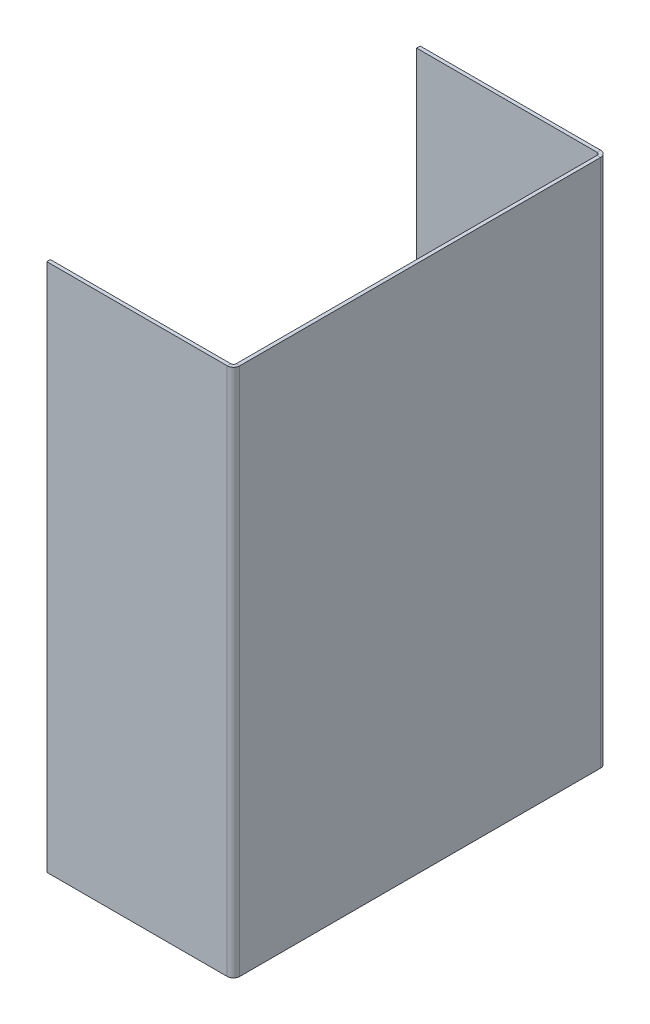
ISO-10303-21;
HEADER;
FILE_DESCRIPTION(('STEP AP214'),'2;1');
FILE_NAME('part.step','',(''),(''),'','','');
FILE_SCHEMA(('AUTOMOTIVE_DESIGN { 1 0 10303 214 1 1 1 1 }'));
ENDSEC;
DATA;
#1=APPLICATION_CONTEXT('core data for automotive mechanical design processes');
#2=APPLICATION_PROTOCOL_DEFINITION('international standard','automotive_design',2000,#1);
#3=PRODUCT_CONTEXT('',#1,'mechanical');
#4=PRODUCT('Part','Part','',(#3));
#5=PRODUCT_RELATED_PRODUCT_CATEGORY('part','',(#4));
#6=PRODUCT_DEFINITION_FORMATION('','',#4);
#7=PRODUCT_DEFINITION_CONTEXT('part definition',#1,'design');
#8=PRODUCT_DEFINITION('design','',#6,#7);
#9=PRODUCT_DEFINITION_SHAPE('','',#8);
#10=(LENGTH_UNIT() NAMED_UNIT(*) SI_UNIT(.MILLI.,.METRE.));
#11=(NAMED_UNIT(*) PLANE_ANGLE_UNIT() SI_UNIT($,.RADIAN.));
#12=(NAMED_UNIT(*) SI_UNIT($,.STERADIAN.) SOLID_ANGLE_UNIT());
#13=UNCERTAINTY_MEASURE_WITH_UNIT(LENGTH_MEASURE(1.E-05),#10,'distance_accuracy_value','');
#14=(GEOMETRIC_REPRESENTATION_CONTEXT(3) GLOBAL_UNCERTAINTY_ASSIGNED_CONTEXT((#13)) GLOBAL_UNIT_ASSIGNED_CONTEXT((#10,
#11,#12)) REPRESENTATION_CONTEXT('',''));
#15=CARTESIAN_POINT('',(0.,0.,0.));
#16=DIRECTION('',(0.,0.,1.));
#17=DIRECTION('',(1.,0.,0.));
#18=AXIS2_PLACEMENT_3D('',#15,#16,#17);
#19=CARTESIAN_POINT('',(51.5596680025109,146.05,-51.0309319974893));
#20=DIRECTION('',(0.,1.,0.));
#21=DIRECTION('',(-1.,0.,0.));
#22=AXIS2_PLACEMENT_3D('',#19,#20,#21);
#23=PLANE('',#22);
#24=DIRECTION('',(0.,0.,-1.));
#25=VECTOR('',#24,1.);
#26=CARTESIAN_POINT('',(50.5690680025109,146.05,-51.0309319974893));
#27=LINE('',#26,#25);
#28=CARTESIAN_POINT('',(50.5690680025103,146.05,100.401536005021));
#29=VERTEX_POINT('',#28);
#30=CARTESIAN_POINT('',(50.5690680025107,146.05,0.736600000000011));
#31=VERTEX_POINT('',#30);
#32=EDGE_CURVE('E74',#29,#31,#27,.T.);
#33=ORIENTED_EDGE('',*,*,#32,.F.);
#34=DIRECTION('',(1.,0.,0.));
#35=VECTOR('',#34,1.);
#36=CARTESIAN_POINT('',(51.5596680025104,146.05,100.401536005021));
#37=LINE('',#36,#35);
#38=CARTESIAN_POINT('',(51.5596680025103,146.05,100.401536005021));
#39=VERTEX_POINT('',#38);
#40=EDGE_CURVE('E244',#29,#39,#37,.T.);
#41=ORIENTED_EDGE('',*,*,#40,.T.);
#42=DIRECTION('',(0.,0.,-1.));
#43=VECTOR('',#42,1.);
#44=CARTESIAN_POINT('',(51.5596680025109,146.05,-51.0309319974893));
#45=LINE('',#44,#43);
#46=CARTESIAN_POINT('',(51.5596680025107,146.05,0.736600000000011));
#47=VERTEX_POINT('',#46);
#48=EDGE_CURVE('E53',#39,#47,#45,.T.);
#49=ORIENTED_EDGE('',*,*,#48,.T.);
#50=DIRECTION('',(1.,0.,0.));
#51=VECTOR('',#50,1.);
#52=CARTESIAN_POINT('',(51.5596680025107,146.05,0.736600000000011));
#53=LINE('',#52,#51);
#54=EDGE_CURVE('E238',#31,#47,#53,.T.);
#55=ORIENTED_EDGE('',*,*,#54,.F.);
#56=EDGE_LOOP('',(#33,#41,#49,#55));
#57=FACE_BOUND('',#56,.T.);
#58=ADVANCED_FACE('F49',(#57),#23,.T.);
#59=CARTESIAN_POINT('',(51.5596680025109,0.,-51.0309319974893));
#60=DIRECTION('',(0.,-1.,0.));
#61=DIRECTION('',(1.,0.,0.));
#62=AXIS2_PLACEMENT_3D('',#59,#60,#61);
#63=PLANE('',#62);
#64=DIRECTION('',(0.,0.,1.));
#65=VECTOR('',#64,1.);
#66=CARTESIAN_POINT('',(51.5596680025109,0.,-51.0309319974893));
#67=LINE('',#66,#65);
#68=CARTESIAN_POINT('',(51.5596680025107,0.,0.736600000000003));
#69=VERTEX_POINT('',#68);
#70=CARTESIAN_POINT('',(51.5596680025104,0.,100.401536005021));
#71=VERTEX_POINT('',#70);
#72=EDGE_CURVE('E248',#69,#71,#67,.T.);
#73=ORIENTED_EDGE('',*,*,#72,.T.);
#74=DIRECTION('',(-1.,0.,0.));
#75=VECTOR('',#74,1.);
#76=CARTESIAN_POINT('',(51.5596680025104,0.,100.401536005021));
#77=LINE('',#76,#75);
#78=CARTESIAN_POINT('',(50.5690680025103,0.,100.401536005021));
#79=VERTEX_POINT('',#78);
#80=EDGE_CURVE('E12',#71,#79,#77,.T.);
#81=ORIENTED_EDGE('',*,*,#80,.T.);
#82=DIRECTION('',(0.,0.,1.));
#83=VECTOR('',#82,1.);
#84=CARTESIAN_POINT('',(50.5690680025109,0.,-51.0309319974893));
#85=LINE('',#84,#83);
#86=CARTESIAN_POINT('',(50.5690680025107,0.,0.736600000000004));
#87=VERTEX_POINT('',#86);
#88=EDGE_CURVE('E200',#87,#79,#85,.T.);
#89=ORIENTED_EDGE('',*,*,#88,.F.);
#90=DIRECTION('',(-1.,0.,0.));
#91=VECTOR('',#90,1.);
#92=CARTESIAN_POINT('',(51.5596680025107,0.,0.736600000000011));
#93=LINE('',#92,#91);
#94=EDGE_CURVE('E233',#69,#87,#93,.T.);
#95=ORIENTED_EDGE('',*,*,#94,.F.);
#96=EDGE_LOOP('',(#73,#81,#89,#95));
#97=FACE_BOUND('',#96,.T.);
#98=ADVANCED_FACE('F51',(#97),#63,.T.);
#99=CARTESIAN_POINT('',(51.5596680025109,0.,-51.0309319974893));
#100=DIRECTION('',(1.,0.,0.));
#101=DIRECTION('',(0.,0.,-1.));
#102=AXIS2_PLACEMENT_3D('',#99,#100,#101);
#103=PLANE('',#102);
#104=ORIENTED_EDGE('',*,*,#48,.F.);
#105=DIRECTION('',(0.,-1.,0.));
#106=VECTOR('',#105,1.);
#107=CARTESIAN_POINT('',(51.5596680025103,0.,100.401536005021));
#108=LINE('',#107,#106);
#109=EDGE_CURVE('E241',#39,#71,#108,.T.);
#110=ORIENTED_EDGE('',*,*,#109,.T.);
#111=ORIENTED_EDGE('',*,*,#72,.F.);
#112=DIRECTION('',(0.,-1.,0.));
#113=VECTOR('',#112,1.);
#114=CARTESIAN_POINT('',(51.5596680025107,0.,0.736600000000011));
#115=LINE('',#114,#113);
#116=EDGE_CURVE('E230',#47,#69,#115,.T.);
#117=ORIENTED_EDGE('',*,*,#116,.F.);
#118=EDGE_LOOP('',(#104,#110,#111,#117));
#119=FACE_BOUND('',#118,.T.);
#120=ADVANCED_FACE('F263',(#119),#103,.T.);
#121=CARTESIAN_POINT('',(50.5690680025109,0.,-51.0309319974893));
#122=DIRECTION('',(1.,0.,0.));
#123=DIRECTION('',(0.,0.,-1.));
#124=AXIS2_PLACEMENT_3D('',#121,#122,#123);
#125=PLANE('',#124);
#126=DIRECTION('',(0.,-1.,0.));
#127=VECTOR('',#126,1.);
#128=CARTESIAN_POINT('',(50.5690680025103,0.,100.401536005021));
#129=LINE('',#128,#127);
#130=EDGE_CURVE('E58',#29,#79,#129,.T.);
#131=ORIENTED_EDGE('',*,*,#130,.F.);
#132=ORIENTED_EDGE('',*,*,#32,.T.);
#133=DIRECTION('',(0.,-1.,0.));
#134=VECTOR('',#133,1.);
#135=CARTESIAN_POINT('',(50.5690680025107,0.,0.736600000000011));
#136=LINE('',#135,#134);
#137=EDGE_CURVE('E236',#31,#87,#136,.T.);
#138=ORIENTED_EDGE('',*,*,#137,.T.);
#139=ORIENTED_EDGE('',*,*,#88,.T.);
#140=EDGE_LOOP('',(#131,#132,#138,#139));
#141=FACE_BOUND('',#140,.T.);
#142=ADVANCED_FACE('F252',(#141),#125,.F.);
#143=CARTESIAN_POINT('',(0.,0.,-0.9906));
#144=DIRECTION('',(-1.,0.,0.));
#145=DIRECTION('',(0.,0.,1.));
#146=AXIS2_PLACEMENT_3D('',#143,#144,#145);
#147=PLANE('',#146);
#148=DIRECTION('',(0.,-1.,0.));
#149=VECTOR('',#148,1.);
#150=CARTESIAN_POINT('',(0.,0.,0.));
#151=LINE('',#150,#149);
#152=CARTESIAN_POINT('',(0.,146.05,0.));
#153=VERTEX_POINT('',#152);
#154=CARTESIAN_POINT('',(0.,0.,0.));
#155=VERTEX_POINT('',#154);
#156=EDGE_CURVE('E209',#153,#155,#151,.T.);
#157=ORIENTED_EDGE('',*,*,#156,.F.);
#158=DIRECTION('',(0.,0.,1.));
#159=VECTOR('',#158,1.);
#160=CARTESIAN_POINT('',(0.,146.05,-0.9906));
#161=LINE('',#160,#159);
#162=CARTESIAN_POINT('',(0.,146.05,-0.9906));
#163=VERTEX_POINT('',#162);
#164=EDGE_CURVE('E197',#163,#153,#161,.T.);
#165=ORIENTED_EDGE('',*,*,#164,.F.);
#166=DIRECTION('',(0.,-1.,0.));
#167=VECTOR('',#166,1.);
#168=CARTESIAN_POINT('',(0.,0.,-0.9906));
#169=LINE('',#168,#167);
#170=CARTESIAN_POINT('',(0.,0.,-0.9906));
#171=VERTEX_POINT('',#170);
#172=EDGE_CURVE('E225',#163,#171,#169,.T.);
#173=ORIENTED_EDGE('',*,*,#172,.T.);
#174=DIRECTION('',(0.,0.,1.));
#175=VECTOR('',#174,1.);
#176=CARTESIAN_POINT('',(0.,0.,-0.9906));
#177=LINE('',#176,#175);
#178=EDGE_CURVE('E223',#171,#155,#177,.T.);
#179=ORIENTED_EDGE('',*,*,#178,.T.);
#180=EDGE_LOOP('',(#157,#165,#173,#179));
#181=FACE_BOUND('',#180,.T.);
#182=ADVANCED_FACE('F302',(#181),#147,.T.);
#183=CARTESIAN_POINT('',(0.,0.,-0.9906));
#184=DIRECTION('',(0.,0.,-1.));
#185=DIRECTION('',(-1.,0.,0.));
#186=AXIS2_PLACEMENT_3D('',#183,#184,#185);
#187=PLANE('',#186);
#188=DIRECTION('',(-1.,0.,0.));
#189=VECTOR('',#188,1.);
#190=CARTESIAN_POINT('',(0.,146.05,-0.9906));
#191=LINE('',#190,#189);
#192=CARTESIAN_POINT('',(49.8324680025107,146.05,-0.9906));
#193=VERTEX_POINT('',#192);
#194=EDGE_CURVE('E201',#193,#163,#191,.T.);
#195=ORIENTED_EDGE('',*,*,#194,.F.);
#196=DIRECTION('',(0.,-1.,0.));
#197=VECTOR('',#196,1.);
#198=CARTESIAN_POINT('',(49.8324680025107,0.,-0.9906));
#199=LINE('',#198,#197);
#200=CARTESIAN_POINT('',(49.8324680025107,0.,-0.9906));
#201=VERTEX_POINT('',#200);
#202=EDGE_CURVE('E220',#193,#201,#199,.T.);
#203=ORIENTED_EDGE('',*,*,#202,.T.);
#204=DIRECTION('',(1.,0.,0.));
#205=VECTOR('',#204,1.);
#206=CARTESIAN_POINT('',(0.,0.,-0.9906));
#207=LINE('',#206,#205);
#208=EDGE_CURVE('E217',#171,#201,#207,.T.);
#209=ORIENTED_EDGE('',*,*,#208,.F.);
#210=ORIENTED_EDGE('',*,*,#172,.F.);
#211=EDGE_LOOP('',(#195,#203,#209,#210));
#212=FACE_BOUND('',#211,.T.);
#213=ADVANCED_FACE('F307',(#212),#187,.T.);
#214=CARTESIAN_POINT('',(0.,0.,-0.9906));
#215=DIRECTION('',(0.,-1.,0.));
#216=DIRECTION('',(0.,0.,-1.));
#217=AXIS2_PLACEMENT_3D('',#214,#215,#216);
#218=PLANE('',#217);
#219=ORIENTED_EDGE('',*,*,#208,.T.);
#220=DIRECTION('',(0.,0.,1.));
#221=VECTOR('',#220,1.);
#222=CARTESIAN_POINT('',(49.8324680025107,0.,-0.9906));
#223=LINE('',#222,#221);
#224=CARTESIAN_POINT('',(49.8324680025107,0.,0.));
#225=VERTEX_POINT('',#224);
#226=EDGE_CURVE('E214',#201,#225,#223,.T.);
#227=ORIENTED_EDGE('',*,*,#226,.T.);
#228=DIRECTION('',(1.,0.,0.));
#229=VECTOR('',#228,1.);
#230=CARTESIAN_POINT('',(0.,0.,0.));
#231=LINE('',#230,#229);
#232=EDGE_CURVE('E206',#155,#225,#231,.T.);
#233=ORIENTED_EDGE('',*,*,#232,.F.);
#234=ORIENTED_EDGE('',*,*,#178,.F.);
#235=EDGE_LOOP('',(#219,#227,#233,#234));
#236=FACE_BOUND('',#235,.T.);
#237=ADVANCED_FACE('F483',(#236),#218,.T.);
#238=CARTESIAN_POINT('',(0.,0.,0.));
#239=DIRECTION('',(0.,0.,-1.));
#240=DIRECTION('',(-1.,0.,0.));
#241=AXIS2_PLACEMENT_3D('',#238,#239,#240);
#242=PLANE('',#241);
#243=DIRECTION('',(0.,-1.,0.));
#244=VECTOR('',#243,1.);
#245=CARTESIAN_POINT('',(49.8324680025107,0.,0.));
#246=LINE('',#245,#244);
#247=CARTESIAN_POINT('',(49.8324680025107,146.05,0.));
#248=VERTEX_POINT('',#247);
#249=EDGE_CURVE('E193',#248,#225,#246,.T.);
#250=ORIENTED_EDGE('',*,*,#249,.F.);
#251=DIRECTION('',(-1.,0.,0.));
#252=VECTOR('',#251,1.);
#253=CARTESIAN_POINT('',(0.,146.05,0.));
#254=LINE('',#253,#252);
#255=EDGE_CURVE('E212',#248,#153,#254,.T.);
#256=ORIENTED_EDGE('',*,*,#255,.T.);
#257=ORIENTED_EDGE('',*,*,#156,.T.);
#258=ORIENTED_EDGE('',*,*,#232,.T.);
#259=EDGE_LOOP('',(#250,#256,#257,#258));
#260=FACE_BOUND('',#259,.T.);
#261=ADVANCED_FACE('F474',(#260),#242,.F.);
#262=CARTESIAN_POINT('',(0.,146.05,-0.9906));
#263=DIRECTION('',(0.,1.,0.));
#264=DIRECTION('',(0.,0.,1.));
#265=AXIS2_PLACEMENT_3D('',#262,#263,#264);
#266=PLANE('',#265);
#267=ORIENTED_EDGE('',*,*,#255,.F.);
#268=DIRECTION('',(0.,0.,-1.));
#269=VECTOR('',#268,1.);
#270=CARTESIAN_POINT('',(49.8324680025107,146.05,-0.9906));
#271=LINE('',#270,#269);
#272=EDGE_CURVE('E203',#248,#193,#271,.T.);
#273=ORIENTED_EDGE('',*,*,#272,.T.);
#274=ORIENTED_EDGE('',*,*,#194,.T.);
#275=ORIENTED_EDGE('',*,*,#164,.T.);
#276=EDGE_LOOP('',(#267,#273,#274,#275));
#277=FACE_BOUND('',#276,.T.);
#278=ADVANCED_FACE('F465',(#277),#266,.T.);
#279=CARTESIAN_POINT('',(49.8324680025107,146.05,0.7366));
#280=DIRECTION('',(0.,1.,0.));
#281=DIRECTION('',(0.,0.,1.));
#282=AXIS2_PLACEMENT_3D('',#279,#280,#281);
#283=PLANE('',#282);
#284=ORIENTED_EDGE('',*,*,#272,.F.);
#285=CARTESIAN_POINT('',(49.8324680025107,146.05,0.7366));
#286=DIRECTION('',(0.,-1.,0.));
#287=DIRECTION('',(1.,0.,0.));
#288=AXIS2_PLACEMENT_3D('',#285,#286,#287);
#289=CIRCLE('',#288,0.7366);
#290=EDGE_CURVE('E182',#248,#31,#289,.T.);
#291=ORIENTED_EDGE('',*,*,#290,.T.);
#292=ORIENTED_EDGE('',*,*,#54,.T.);
#293=CARTESIAN_POINT('',(49.8324680025107,146.05,0.7366));
#294=DIRECTION('',(0.,-1.,0.));
#295=DIRECTION('',(0.,0.,1.));
#296=AXIS2_PLACEMENT_3D('',#293,#294,#295);
#297=CIRCLE('',#296,1.7272);
#298=EDGE_CURVE('E186',#193,#47,#297,.T.);
#299=ORIENTED_EDGE('',*,*,#298,.F.);
#300=EDGE_LOOP('',(#284,#291,#292,#299));
#301=FACE_BOUND('',#300,.T.);
#302=ADVANCED_FACE('F456',(#301),#283,.T.);
#303=CARTESIAN_POINT('',(49.8324680025107,0.,0.7366));
#304=DIRECTION('',(0.,-1.,0.));
#305=DIRECTION('',(1.,0.,0.));
#306=AXIS2_PLACEMENT_3D('',#303,#304,#305);
#307=PLANE('',#306);
#308=CARTESIAN_POINT('',(49.8324680025107,0.,0.7366));
#309=DIRECTION('',(0.,-1.,0.));
#310=DIRECTION('',(1.,0.,0.));
#311=AXIS2_PLACEMENT_3D('',#308,#309,#310);
#312=CIRCLE('',#311,0.7366);
#313=EDGE_CURVE('E190',#87,#225,#312,.F.);
#314=ORIENTED_EDGE('',*,*,#313,.T.);
#315=ORIENTED_EDGE('',*,*,#226,.F.);
#316=CARTESIAN_POINT('',(49.8324680025107,0.,0.7366));
#317=DIRECTION('',(0.,1.,0.));
#318=DIRECTION('',(1.,0.,0.));
#319=AXIS2_PLACEMENT_3D('',#316,#317,#318);
#320=CIRCLE('',#319,1.7272);
#321=EDGE_CURVE('E189',#69,#201,#320,.T.);
#322=ORIENTED_EDGE('',*,*,#321,.F.);
#323=ORIENTED_EDGE('',*,*,#94,.T.);
#324=EDGE_LOOP('',(#314,#315,#322,#323));
#325=FACE_BOUND('',#324,.T.);
#326=ADVANCED_FACE('F446',(#325),#307,.T.);
#327=CARTESIAN_POINT('',(49.8324680025107,219.091177676506,0.7366));
#328=DIRECTION('',(0.,-1.,0.));
#329=DIRECTION('',(1.,0.,0.));
#330=AXIS2_PLACEMENT_3D('',#327,#328,#329);
#331=CYLINDRICAL_SURFACE('',#330,1.7272);
#332=ORIENTED_EDGE('',*,*,#116,.T.);
#333=ORIENTED_EDGE('',*,*,#321,.T.);
#334=ORIENTED_EDGE('',*,*,#202,.F.);
#335=ORIENTED_EDGE('',*,*,#298,.T.);
#336=EDGE_LOOP('',(#332,#333,#334,#335));
#337=FACE_BOUND('',#336,.T.);
#338=ADVANCED_FACE('F437',(#337),#331,.T.);
#339=CARTESIAN_POINT('',(49.8324680025107,219.091177676506,0.7366));
#340=DIRECTION('',(0.,-1.,0.));
#341=DIRECTION('',(1.,0.,0.));
#342=AXIS2_PLACEMENT_3D('',#339,#340,#341);
#343=CYLINDRICAL_SURFACE('',#342,0.7366);
#344=ORIENTED_EDGE('',*,*,#137,.F.);
#345=ORIENTED_EDGE('',*,*,#290,.F.);
#346=ORIENTED_EDGE('',*,*,#249,.T.);
#347=ORIENTED_EDGE('',*,*,#313,.F.);
#348=EDGE_LOOP('',(#344,#345,#346,#347));
#349=FACE_BOUND('',#348,.T.);
#350=ADVANCED_FACE('F347',(#349),#343,.F.);
#351=CARTESIAN_POINT('',(49.8324680025104,146.05,100.401536005021));
#352=DIRECTION('',(0.,1.,0.));
#353=DIRECTION('',(0.,0.,1.));
#354=AXIS2_PLACEMENT_3D('',#351,#352,#353);
#355=PLANE('',#354);
#356=ORIENTED_EDGE('',*,*,#40,.F.);
#357=CARTESIAN_POINT('',(49.8324680025104,146.05,100.401536005021));
#358=DIRECTION('',(0.,-1.,0.));
#359=DIRECTION('',(0.,0.,-1.));
#360=AXIS2_PLACEMENT_3D('',#357,#358,#359);
#361=CIRCLE('',#360,0.7366);
#362=CARTESIAN_POINT('',(49.8324680025103,146.05,101.138136005021));
#363=VERTEX_POINT('',#362);
#364=EDGE_CURVE('E160',#29,#363,#361,.T.);
#365=ORIENTED_EDGE('',*,*,#364,.T.);
#366=DIRECTION('',(0.,0.,1.));
#367=VECTOR('',#366,1.);
#368=CARTESIAN_POINT('',(49.8324680025103,146.05,102.128736005021));
#369=LINE('',#368,#367);
#370=CARTESIAN_POINT('',(49.8324680025103,146.05,102.128736005021));
#371=VERTEX_POINT('',#370);
#372=EDGE_CURVE('E166',#363,#371,#369,.T.);
#373=ORIENTED_EDGE('',*,*,#372,.T.);
#374=CARTESIAN_POINT('',(49.8324680025104,146.05,100.401536005021));
#375=DIRECTION('',(0.,-1.,0.));
#376=DIRECTION('',(0.,0.,1.));
#377=AXIS2_PLACEMENT_3D('',#374,#375,#376);
#378=CIRCLE('',#377,1.72720000000001);
#379=EDGE_CURVE('E176',#39,#371,#378,.T.);
#380=ORIENTED_EDGE('',*,*,#379,.F.);
#381=EDGE_LOOP('',(#356,#365,#373,#380));
#382=FACE_BOUND('',#381,.T.);
#383=ADVANCED_FACE('F268',(#382),#355,.T.);
#384=CARTESIAN_POINT('',(49.8324680025104,0.,100.401536005021));
#385=DIRECTION('',(0.,-1.,0.));
#386=DIRECTION('',(0.,0.,-1.));
#387=AXIS2_PLACEMENT_3D('',#384,#385,#386);
#388=PLANE('',#387);
#389=CARTESIAN_POINT('',(49.8324680025104,0.,100.401536005021));
#390=DIRECTION('',(0.,-1.,0.));
#391=DIRECTION('',(0.,0.,-1.));
#392=AXIS2_PLACEMENT_3D('',#389,#390,#391);
#393=CIRCLE('',#392,0.7366);
#394=CARTESIAN_POINT('',(49.8324680025103,0.,101.138136005021));
#395=VERTEX_POINT('',#394);
#396=EDGE_CURVE('E66',#395,#79,#393,.F.);
#397=ORIENTED_EDGE('',*,*,#396,.T.);
#398=ORIENTED_EDGE('',*,*,#80,.F.);
#399=CARTESIAN_POINT('',(49.8324680025104,0.,100.401536005021));
#400=DIRECTION('',(0.,1.,0.));
#401=DIRECTION('',(0.,0.,-1.));
#402=AXIS2_PLACEMENT_3D('',#399,#400,#401);
#403=CIRCLE('',#402,1.72720000000001);
#404=CARTESIAN_POINT('',(49.8324680025103,0.,102.128736005021));
#405=VERTEX_POINT('',#404);
#406=EDGE_CURVE('E179',#405,#71,#403,.T.);
#407=ORIENTED_EDGE('',*,*,#406,.F.);
#408=DIRECTION('',(0.,0.,-1.));
#409=VECTOR('',#408,1.);
#410=CARTESIAN_POINT('',(49.8324680025103,0.,102.128736005021));
#411=LINE('',#410,#409);
#412=EDGE_CURVE('E148',#405,#395,#411,.T.);
#413=ORIENTED_EDGE('',*,*,#412,.T.);
#414=EDGE_LOOP('',(#397,#398,#407,#413));
#415=FACE_BOUND('',#414,.T.);
#416=ADVANCED_FACE('F257',(#415),#388,.T.);
#417=CARTESIAN_POINT('',(49.8324680025103,219.091177676506,100.401536005021));
#418=DIRECTION('',(0.,-1.,0.));
#419=DIRECTION('',(0.,0.,-1.));
#420=AXIS2_PLACEMENT_3D('',#417,#418,#419);
#421=CYLINDRICAL_SURFACE('',#420,1.7272);
#422=DIRECTION('',(0.,-1.,0.));
#423=VECTOR('',#422,1.);
#424=CARTESIAN_POINT('',(49.8324680025103,0.,102.128736005021));
#425=LINE('',#424,#423);
#426=EDGE_CURVE('E174',#371,#405,#425,.T.);
#427=ORIENTED_EDGE('',*,*,#426,.T.);
#428=ORIENTED_EDGE('',*,*,#406,.T.);
#429=ORIENTED_EDGE('',*,*,#109,.F.);
#430=ORIENTED_EDGE('',*,*,#379,.T.);
#431=EDGE_LOOP('',(#427,#428,#429,#430));
#432=FACE_BOUND('',#431,.T.);
#433=ADVANCED_FACE('F259',(#432),#421,.T.);
#434=CARTESIAN_POINT('',(49.8324680025103,219.091177676506,100.401536005021));
#435=DIRECTION('',(0.,-1.,0.));
#436=DIRECTION('',(0.,0.,-1.));
#437=AXIS2_PLACEMENT_3D('',#434,#435,#436);
#438=CYLINDRICAL_SURFACE('',#437,0.7366);
#439=DIRECTION('',(0.,-1.,0.));
#440=VECTOR('',#439,1.);
#441=CARTESIAN_POINT('',(49.8324680025103,0.,101.138136005021));
#442=LINE('',#441,#440);
#443=EDGE_CURVE('E273',#363,#395,#442,.T.);
#444=ORIENTED_EDGE('',*,*,#443,.F.);
#445=ORIENTED_EDGE('',*,*,#364,.F.);
#446=ORIENTED_EDGE('',*,*,#130,.T.);
#447=ORIENTED_EDGE('',*,*,#396,.F.);
#448=EDGE_LOOP('',(#444,#445,#446,#447));
#449=FACE_BOUND('',#448,.T.);
#450=ADVANCED_FACE('F271',(#449),#438,.F.);
#451=CARTESIAN_POINT('',(-2.77555756156289E-13,0.,102.128736005021));
#452=DIRECTION('',(-1.,0.,0.));
#453=DIRECTION('',(0.,0.,1.));
#454=AXIS2_PLACEMENT_3D('',#451,#452,#453);
#455=PLANE('',#454);
#456=DIRECTION('',(0.,1.,0.));
#457=VECTOR('',#456,1.);
#458=CARTESIAN_POINT('',(-2.77555756156289E-13,0.,101.138136005021));
#459=LINE('',#458,#457);
#460=CARTESIAN_POINT('',(-2.77555756156289E-13,0.,101.138136005021));
#461=VERTEX_POINT('',#460);
#462=CARTESIAN_POINT('',(-3.05311331771918E-13,146.05,101.138136005021));
#463=VERTEX_POINT('',#462);
#464=EDGE_CURVE('E152',#461,#463,#459,.T.);
#465=ORIENTED_EDGE('',*,*,#464,.F.);
#466=DIRECTION('',(0.,0.,-1.));
#467=VECTOR('',#466,1.);
#468=CARTESIAN_POINT('',(-2.77555756156289E-13,0.,102.128736005021));
#469=LINE('',#468,#467);
#470=CARTESIAN_POINT('',(-2.77555756156289E-13,0.,102.128736005021));
#471=VERTEX_POINT('',#470);
#472=EDGE_CURVE('E146',#471,#461,#469,.T.);
#473=ORIENTED_EDGE('',*,*,#472,.F.);
#474=DIRECTION('',(0.,1.,0.));
#475=VECTOR('',#474,1.);
#476=CARTESIAN_POINT('',(-2.77555756156289E-13,0.,102.128736005021));
#477=LINE('',#476,#475);
#478=CARTESIAN_POINT('',(-3.05311331771918E-13,146.05,102.128736005021));
#479=VERTEX_POINT('',#478);
#480=EDGE_CURVE('E157',#471,#479,#477,.T.);
#481=ORIENTED_EDGE('',*,*,#480,.T.);
#482=DIRECTION('',(0.,0.,-1.));
#483=VECTOR('',#482,1.);
#484=CARTESIAN_POINT('',(-3.05311331771918E-13,146.05,102.128736005021));
#485=LINE('',#484,#483);
#486=EDGE_CURVE('E165',#479,#463,#485,.T.);
#487=ORIENTED_EDGE('',*,*,#486,.T.);
#488=EDGE_LOOP('',(#465,#473,#481,#487));
#489=FACE_BOUND('',#488,.T.);
#490=ADVANCED_FACE('F156',(#489),#455,.T.);
#491=CARTESIAN_POINT('',(203.2,0.,102.128736005022));
#492=DIRECTION('',(0.,0.,1.));
#493=DIRECTION('',(1.,0.,0.));
#494=AXIS2_PLACEMENT_3D('',#491,#492,#493);
#495=PLANE('',#494);
#496=ORIENTED_EDGE('',*,*,#426,.F.);
#497=DIRECTION('',(1.,0.,0.));
#498=VECTOR('',#497,1.);
#499=CARTESIAN_POINT('',(203.2,146.05,102.128736005022));
#500=LINE('',#499,#498);
#501=EDGE_CURVE('E164',#479,#371,#500,.T.);
#502=ORIENTED_EDGE('',*,*,#501,.F.);
#503=ORIENTED_EDGE('',*,*,#480,.F.);
#504=DIRECTION('',(-1.,0.,0.));
#505=VECTOR('',#504,1.);
#506=CARTESIAN_POINT('',(203.2,0.,102.128736005022));
#507=LINE('',#506,#505);
#508=EDGE_CURVE('E143',#405,#471,#507,.T.);
#509=ORIENTED_EDGE('',*,*,#508,.F.);
#510=EDGE_LOOP('',(#496,#502,#503,#509));
#511=FACE_BOUND('',#510,.T.);
#512=ADVANCED_FACE('F162',(#511),#495,.T.);
#513=CARTESIAN_POINT('',(203.2,146.05,102.128736005022));
#514=DIRECTION('',(0.,1.,0.));
#515=DIRECTION('',(0.,0.,-1.));
#516=AXIS2_PLACEMENT_3D('',#513,#514,#515);
#517=PLANE('',#516);
#518=ORIENTED_EDGE('',*,*,#372,.F.);
#519=DIRECTION('',(1.,0.,0.));
#520=VECTOR('',#519,1.);
#521=CARTESIAN_POINT('',(203.2,146.05,101.138136005022));
#522=LINE('',#521,#520);
#523=EDGE_CURVE('E276',#463,#363,#522,.T.);
#524=ORIENTED_EDGE('',*,*,#523,.F.);
#525=ORIENTED_EDGE('',*,*,#486,.F.);
#526=ORIENTED_EDGE('',*,*,#501,.T.);
#527=EDGE_LOOP('',(#518,#524,#525,#526));
#528=FACE_BOUND('',#527,.T.);
#529=ADVANCED_FACE('F283',(#528),#517,.T.);
#530=CARTESIAN_POINT('',(203.2,0.,101.138136005022));
#531=DIRECTION('',(0.,0.,1.));
#532=DIRECTION('',(1.,0.,0.));
#533=AXIS2_PLACEMENT_3D('',#530,#531,#532);
#534=PLANE('',#533);
#535=ORIENTED_EDGE('',*,*,#523,.T.);
#536=ORIENTED_EDGE('',*,*,#443,.T.);
#537=DIRECTION('',(-1.,0.,0.));
#538=VECTOR('',#537,1.);
#539=CARTESIAN_POINT('',(203.2,0.,101.138136005022));
#540=LINE('',#539,#538);
#541=EDGE_CURVE('E275',#395,#461,#540,.T.);
#542=ORIENTED_EDGE('',*,*,#541,.T.);
#543=ORIENTED_EDGE('',*,*,#464,.T.);
#544=EDGE_LOOP('',(#535,#536,#542,#543));
#545=FACE_BOUND('',#544,.T.);
#546=ADVANCED_FACE('F285',(#545),#534,.F.);
#547=CARTESIAN_POINT('',(203.2,0.,102.128736005022));
#548=DIRECTION('',(0.,-1.,0.));
#549=DIRECTION('',(0.,0.,1.));
#550=AXIS2_PLACEMENT_3D('',#547,#548,#549);
#551=PLANE('',#550);
#552=ORIENTED_EDGE('',*,*,#412,.F.);
#553=ORIENTED_EDGE('',*,*,#508,.T.);
#554=ORIENTED_EDGE('',*,*,#472,.T.);
#555=ORIENTED_EDGE('',*,*,#541,.F.);
#556=EDGE_LOOP('',(#552,#553,#554,#555));
#557=FACE_BOUND('',#556,.T.);
#558=ADVANCED_FACE('F145',(#557),#551,.T.);
#559=CLOSED_SHELL('',(#58,#98,#120,#142,#182,#213,#237,#261,#278,#302,#326,#338,#350,#383,#416,
#433,#450,#490,#512,#529,#546,#558));
#560=MANIFOLD_SOLID_BREP('B2',#559);
#561=ADVANCED_BREP_SHAPE_REPRESENTATION('',(#18,#560),#14);
#562=SHAPE_DEFINITION_REPRESENTATION(#9,#561);
ENDSEC;
END-ISO-10303-21;
